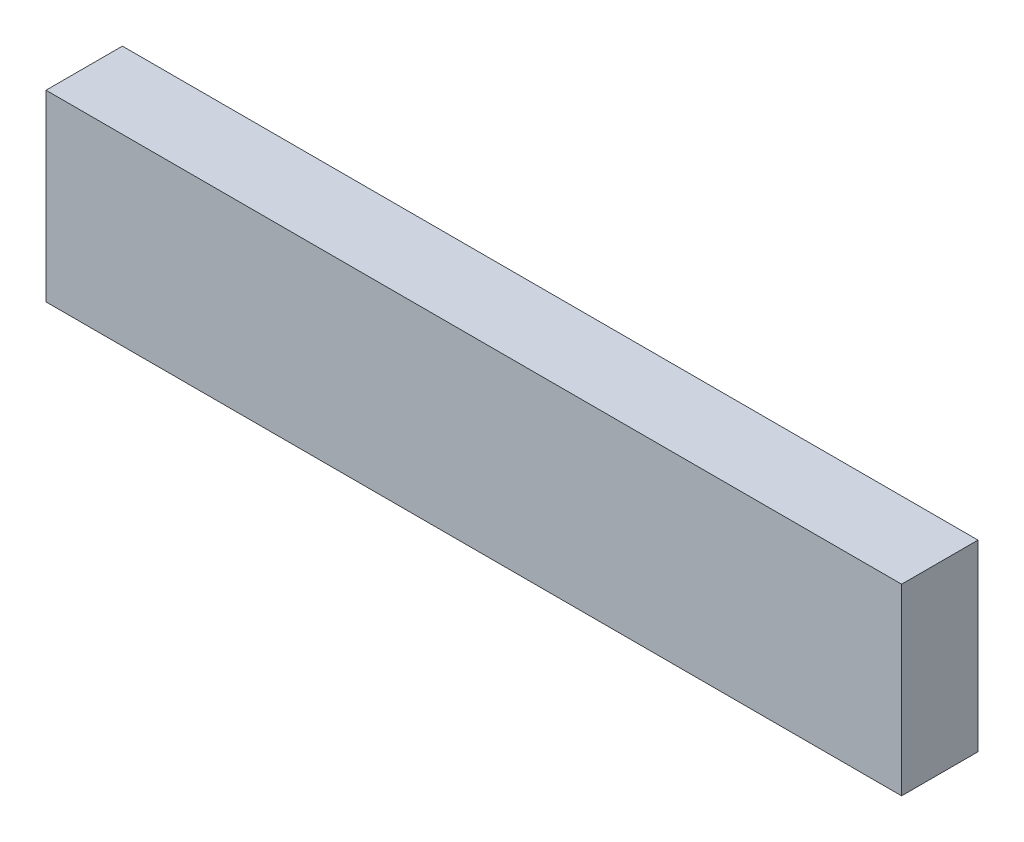
ISO-10303-21;
HEADER;
FILE_DESCRIPTION(('STEP AP214'),'2;1');
FILE_NAME('part.step','',(''),(''),'','','');
FILE_SCHEMA(('AUTOMOTIVE_DESIGN { 1 0 10303 214 1 1 1 1 }'));
ENDSEC;
DATA;
#1=APPLICATION_CONTEXT('core data for automotive mechanical design processes');
#2=APPLICATION_PROTOCOL_DEFINITION('international standard','automotive_design',2000,#1);
#3=PRODUCT_CONTEXT('',#1,'mechanical');
#4=PRODUCT('Part','Part','',(#3));
#5=PRODUCT_RELATED_PRODUCT_CATEGORY('part','',(#4));
#6=PRODUCT_DEFINITION_FORMATION('','',#4);
#7=PRODUCT_DEFINITION_CONTEXT('part definition',#1,'design');
#8=PRODUCT_DEFINITION('design','',#6,#7);
#9=PRODUCT_DEFINITION_SHAPE('','',#8);
#10=(LENGTH_UNIT() NAMED_UNIT(*) SI_UNIT(.MILLI.,.METRE.));
#11=(NAMED_UNIT(*) PLANE_ANGLE_UNIT() SI_UNIT($,.RADIAN.));
#12=(NAMED_UNIT(*) SI_UNIT($,.STERADIAN.) SOLID_ANGLE_UNIT());
#13=UNCERTAINTY_MEASURE_WITH_UNIT(LENGTH_MEASURE(1.E-05),#10,'distance_accuracy_value','');
#14=(GEOMETRIC_REPRESENTATION_CONTEXT(3) GLOBAL_UNCERTAINTY_ASSIGNED_CONTEXT((#13)) GLOBAL_UNIT_ASSIGNED_CONTEXT((#10,
#11,#12)) REPRESENTATION_CONTEXT('',''));
#15=CARTESIAN_POINT('',(0.,0.,0.));
#16=DIRECTION('',(0.,0.,1.));
#17=DIRECTION('',(1.,0.,0.));
#18=AXIS2_PLACEMENT_3D('',#15,#16,#17);
#19=CARTESIAN_POINT('',(-37.2459827210369,15.4103194103194,5.));
#20=DIRECTION('',(1.,0.,0.));
#21=DIRECTION('',(0.,0.,-1.));
#22=AXIS2_PLACEMENT_3D('',#19,#20,#21);
#23=PLANE('',#22);
#24=DIRECTION('',(0.,-1.,0.));
#25=VECTOR('',#24,1.);
#26=CARTESIAN_POINT('',(-37.2459827210369,15.4103194103194,0.));
#27=LINE('',#26,#25);
#28=CARTESIAN_POINT('',(-37.2459827210369,15.4103194103194,0.));
#29=VERTEX_POINT('',#28);
#30=CARTESIAN_POINT('',(-37.2459827210369,3.41031941031941,0.));
#31=VERTEX_POINT('',#30);
#32=EDGE_CURVE('E107',#29,#31,#27,.T.);
#33=ORIENTED_EDGE('',*,*,#32,.T.);
#34=DIRECTION('',(0.,0.,-1.));
#35=VECTOR('',#34,1.);
#36=CARTESIAN_POINT('',(-37.2459827210369,3.41031941031941,5.));
#37=LINE('',#36,#35);
#38=CARTESIAN_POINT('',(-37.2459827210369,3.41031941031941,5.));
#39=VERTEX_POINT('',#38);
#40=EDGE_CURVE('E11',#39,#31,#37,.T.);
#41=ORIENTED_EDGE('',*,*,#40,.F.);
#42=DIRECTION('',(0.,-1.,0.));
#43=VECTOR('',#42,1.);
#44=CARTESIAN_POINT('',(-37.2459827210369,15.4103194103194,5.));
#45=LINE('',#44,#43);
#46=CARTESIAN_POINT('',(-37.2459827210369,15.4103194103194,5.));
#47=VERTEX_POINT('',#46);
#48=EDGE_CURVE('E91',#47,#39,#45,.T.);
#49=ORIENTED_EDGE('',*,*,#48,.F.);
#50=DIRECTION('',(0.,0.,-1.));
#51=VECTOR('',#50,1.);
#52=CARTESIAN_POINT('',(-37.2459827210369,15.4103194103194,5.));
#53=LINE('',#52,#51);
#54=EDGE_CURVE('E103',#47,#29,#53,.T.);
#55=ORIENTED_EDGE('',*,*,#54,.T.);
#56=EDGE_LOOP('',(#33,#41,#49,#55));
#57=FACE_BOUND('',#56,.T.);
#58=ADVANCED_FACE('F39',(#57),#23,.F.);
#59=CARTESIAN_POINT('',(-37.2459827210369,3.41031941031941,5.));
#60=DIRECTION('',(0.,1.,0.));
#61=DIRECTION('',(0.,0.,1.));
#62=AXIS2_PLACEMENT_3D('',#59,#60,#61);
#63=PLANE('',#62);
#64=DIRECTION('',(1.,0.,0.));
#65=VECTOR('',#64,1.);
#66=CARTESIAN_POINT('',(-37.2459827210369,3.41031941031941,0.));
#67=LINE('',#66,#65);
#68=CARTESIAN_POINT('',(18.7540172789631,3.41031941031941,0.));
#69=VERTEX_POINT('',#68);
#70=EDGE_CURVE('E96',#31,#69,#67,.T.);
#71=ORIENTED_EDGE('',*,*,#70,.T.);
#72=DIRECTION('',(0.,0.,-1.));
#73=VECTOR('',#72,1.);
#74=CARTESIAN_POINT('',(18.7540172789631,3.41031941031941,5.));
#75=LINE('',#74,#73);
#76=CARTESIAN_POINT('',(18.7540172789631,3.41031941031941,5.));
#77=VERTEX_POINT('',#76);
#78=EDGE_CURVE('E48',#77,#69,#75,.T.);
#79=ORIENTED_EDGE('',*,*,#78,.F.);
#80=DIRECTION('',(1.,0.,0.));
#81=VECTOR('',#80,1.);
#82=CARTESIAN_POINT('',(-37.2459827210369,3.41031941031941,5.));
#83=LINE('',#82,#81);
#84=EDGE_CURVE('E86',#39,#77,#83,.T.);
#85=ORIENTED_EDGE('',*,*,#84,.F.);
#86=ORIENTED_EDGE('',*,*,#40,.T.);
#87=EDGE_LOOP('',(#71,#79,#85,#86));
#88=FACE_BOUND('',#87,.T.);
#89=ADVANCED_FACE('F95',(#88),#63,.F.);
#90=CARTESIAN_POINT('',(18.7540172789631,15.4103194103194,5.));
#91=DIRECTION('',(-1.,0.,0.));
#92=DIRECTION('',(0.,-1.,0.));
#93=AXIS2_PLACEMENT_3D('',#90,#91,#92);
#94=PLANE('',#93);
#95=DIRECTION('',(0.,1.,0.));
#96=VECTOR('',#95,1.);
#97=CARTESIAN_POINT('',(18.7540172789631,15.4103194103194,0.));
#98=LINE('',#97,#96);
#99=CARTESIAN_POINT('',(18.7540172789631,15.4103194103194,0.));
#100=VERTEX_POINT('',#99);
#101=EDGE_CURVE('E73',#69,#100,#98,.T.);
#102=ORIENTED_EDGE('',*,*,#101,.T.);
#103=DIRECTION('',(0.,0.,-1.));
#104=VECTOR('',#103,1.);
#105=CARTESIAN_POINT('',(18.7540172789631,15.4103194103194,5.));
#106=LINE('',#105,#104);
#107=CARTESIAN_POINT('',(18.7540172789631,15.4103194103194,5.));
#108=VERTEX_POINT('',#107);
#109=EDGE_CURVE('E98',#108,#100,#106,.T.);
#110=ORIENTED_EDGE('',*,*,#109,.F.);
#111=DIRECTION('',(0.,1.,0.));
#112=VECTOR('',#111,1.);
#113=CARTESIAN_POINT('',(18.7540172789631,15.4103194103194,5.));
#114=LINE('',#113,#112);
#115=EDGE_CURVE('E89',#77,#108,#114,.T.);
#116=ORIENTED_EDGE('',*,*,#115,.F.);
#117=ORIENTED_EDGE('',*,*,#78,.T.);
#118=EDGE_LOOP('',(#102,#110,#116,#117));
#119=FACE_BOUND('',#118,.T.);
#120=ADVANCED_FACE('F99',(#119),#94,.F.);
#121=CARTESIAN_POINT('',(-37.2459827210369,15.4103194103194,5.));
#122=DIRECTION('',(0.,-1.,0.));
#123=DIRECTION('',(0.,0.,-1.));
#124=AXIS2_PLACEMENT_3D('',#121,#122,#123);
#125=PLANE('',#124);
#126=DIRECTION('',(-1.,0.,0.));
#127=VECTOR('',#126,1.);
#128=CARTESIAN_POINT('',(-37.2459827210369,15.4103194103194,0.));
#129=LINE('',#128,#127);
#130=EDGE_CURVE('E79',#100,#29,#129,.T.);
#131=ORIENTED_EDGE('',*,*,#130,.T.);
#132=ORIENTED_EDGE('',*,*,#54,.F.);
#133=DIRECTION('',(-1.,0.,0.));
#134=VECTOR('',#133,1.);
#135=CARTESIAN_POINT('',(-37.2459827210369,15.4103194103194,5.));
#136=LINE('',#135,#134);
#137=EDGE_CURVE('E56',#108,#47,#136,.T.);
#138=ORIENTED_EDGE('',*,*,#137,.F.);
#139=ORIENTED_EDGE('',*,*,#109,.T.);
#140=EDGE_LOOP('',(#131,#132,#138,#139));
#141=FACE_BOUND('',#140,.T.);
#142=ADVANCED_FACE('F120',(#141),#125,.F.);
#143=CARTESIAN_POINT('',(0.,0.,5.));
#144=DIRECTION('',(0.,0.,1.));
#145=DIRECTION('',(1.,0.,0.));
#146=AXIS2_PLACEMENT_3D('',#143,#144,#145);
#147=PLANE('',#146);
#148=ORIENTED_EDGE('',*,*,#48,.T.);
#149=ORIENTED_EDGE('',*,*,#84,.T.);
#150=ORIENTED_EDGE('',*,*,#115,.T.);
#151=ORIENTED_EDGE('',*,*,#137,.T.);
#152=EDGE_LOOP('',(#148,#149,#150,#151));
#153=FACE_BOUND('',#152,.T.);
#154=ADVANCED_FACE('F87',(#153),#147,.T.);
#155=CARTESIAN_POINT('',(0.,0.,0.));
#156=DIRECTION('',(0.,0.,1.));
#157=DIRECTION('',(1.,0.,0.));
#158=AXIS2_PLACEMENT_3D('',#155,#156,#157);
#159=PLANE('',#158);
#160=ORIENTED_EDGE('',*,*,#32,.F.);
#161=ORIENTED_EDGE('',*,*,#130,.F.);
#162=ORIENTED_EDGE('',*,*,#101,.F.);
#163=ORIENTED_EDGE('',*,*,#70,.F.);
#164=EDGE_LOOP('',(#160,#161,#162,#163));
#165=FACE_BOUND('',#164,.T.);
#166=ADVANCED_FACE('F123',(#165),#159,.F.);
#167=CLOSED_SHELL('',(#58,#89,#120,#142,#154,#166));
#168=MANIFOLD_SOLID_BREP('B2',#167);
#169=ADVANCED_BREP_SHAPE_REPRESENTATION('',(#18,#168),#14);
#170=SHAPE_DEFINITION_REPRESENTATION(#9,#169);
ENDSEC;
END-ISO-10303-21;
